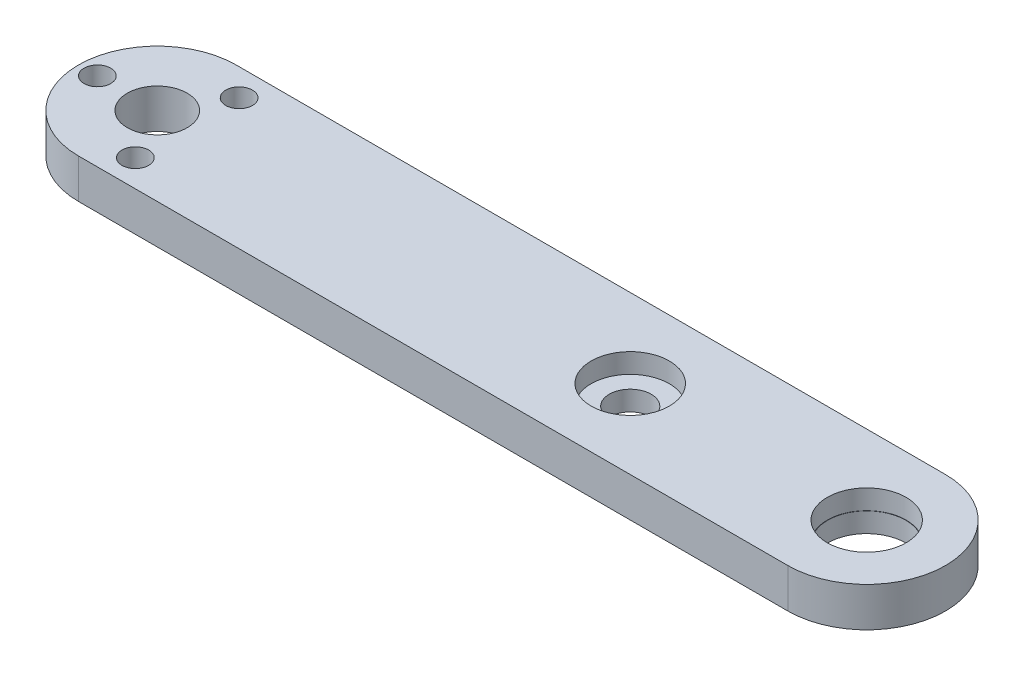
ISO-10303-21;
HEADER;
FILE_DESCRIPTION(('STEP AP214'),'2;1');
FILE_NAME('part.step','',(''),(''),'','','');
FILE_SCHEMA(('AUTOMOTIVE_DESIGN { 1 0 10303 214 1 1 1 1 }'));
ENDSEC;
DATA;
#1=APPLICATION_CONTEXT('core data for automotive mechanical design processes');
#2=APPLICATION_PROTOCOL_DEFINITION('international standard','automotive_design',2000,#1);
#3=PRODUCT_CONTEXT('',#1,'mechanical');
#4=PRODUCT('Part','Part','',(#3));
#5=PRODUCT_RELATED_PRODUCT_CATEGORY('part','',(#4));
#6=PRODUCT_DEFINITION_FORMATION('','',#4);
#7=PRODUCT_DEFINITION_CONTEXT('part definition',#1,'design');
#8=PRODUCT_DEFINITION('design','',#6,#7);
#9=PRODUCT_DEFINITION_SHAPE('','',#8);
#10=(LENGTH_UNIT() NAMED_UNIT(*) SI_UNIT(.MILLI.,.METRE.));
#11=(NAMED_UNIT(*) PLANE_ANGLE_UNIT() SI_UNIT($,.RADIAN.));
#12=(NAMED_UNIT(*) SI_UNIT($,.STERADIAN.) SOLID_ANGLE_UNIT());
#13=UNCERTAINTY_MEASURE_WITH_UNIT(LENGTH_MEASURE(1.E-05),#10,'distance_accuracy_value','');
#14=(GEOMETRIC_REPRESENTATION_CONTEXT(3) GLOBAL_UNCERTAINTY_ASSIGNED_CONTEXT((#13)) GLOBAL_UNIT_ASSIGNED_CONTEXT((#10,
#11,#12)) REPRESENTATION_CONTEXT('',''));
#15=CARTESIAN_POINT('',(0.,0.,0.));
#16=DIRECTION('',(0.,0.,1.));
#17=DIRECTION('',(1.,0.,0.));
#18=AXIS2_PLACEMENT_3D('',#15,#16,#17);
#19=CARTESIAN_POINT('',(0.,6.35,0.));
#20=DIRECTION('',(0.,1.,0.));
#21=DIRECTION('',(0.,0.,1.));
#22=AXIS2_PLACEMENT_3D('',#19,#20,#21);
#23=PLANE('',#22);
#24=CARTESIAN_POINT('',(76.2,6.35,0.));
#25=DIRECTION('',(0.,1.,0.));
#26=DIRECTION('',(0.,0.,1.));
#27=AXIS2_PLACEMENT_3D('',#24,#25,#26);
#28=CIRCLE('',#27,6.29919999999999);
#29=CARTESIAN_POINT('',(76.2,6.35,6.29919999999999));
#30=VERTEX_POINT('',#29);
#31=EDGE_CURVE('E308',#30,#30,#28,.T.);
#32=ORIENTED_EDGE('',*,*,#31,.F.);
#33=EDGE_LOOP('',(#32));
#34=FACE_BOUND('',#33,.T.);
#35=CARTESIAN_POINT('',(114.3,6.35,0.));
#36=DIRECTION('',(0.,1.,0.));
#37=DIRECTION('',(0.,0.,1.));
#38=AXIS2_PLACEMENT_3D('',#35,#36,#37);
#39=CIRCLE('',#38,6.35);
#40=CARTESIAN_POINT('',(114.3,6.35,6.34999999999998));
#41=VERTEX_POINT('',#40);
#42=EDGE_CURVE('E301',#41,#41,#39,.T.);
#43=ORIENTED_EDGE('',*,*,#42,.F.);
#44=EDGE_LOOP('',(#43));
#45=FACE_BOUND('',#44,.T.);
#46=CARTESIAN_POINT('',(-9.652,6.35,0.));
#47=DIRECTION('',(0.,1.,0.));
#48=DIRECTION('',(0.,0.,1.));
#49=AXIS2_PLACEMENT_3D('',#46,#47,#48);
#50=CIRCLE('',#49,2.15265);
#51=CARTESIAN_POINT('',(-9.652,6.35,2.15265));
#52=VERTEX_POINT('',#51);
#53=EDGE_CURVE('E125',#52,#52,#50,.T.);
#54=ORIENTED_EDGE('',*,*,#53,.F.);
#55=EDGE_LOOP('',(#54));
#56=FACE_BOUND('',#55,.T.);
#57=CARTESIAN_POINT('',(4.82600000000004,6.35,-8.35887719732738));
#58=DIRECTION('',(0.,1.,0.));
#59=DIRECTION('',(0.,0.,1.));
#60=AXIS2_PLACEMENT_3D('',#57,#58,#59);
#61=CIRCLE('',#60,2.15265);
#62=CARTESIAN_POINT('',(4.82600000000004,6.35,-6.20622719732738));
#63=VERTEX_POINT('',#62);
#64=EDGE_CURVE('E115',#63,#63,#61,.T.);
#65=ORIENTED_EDGE('',*,*,#64,.F.);
#66=EDGE_LOOP('',(#65));
#67=FACE_BOUND('',#66,.T.);
#68=CARTESIAN_POINT('',(4.82600000000004,6.35,8.35887719732738));
#69=DIRECTION('',(0.,1.,0.));
#70=DIRECTION('',(0.,0.,1.));
#71=AXIS2_PLACEMENT_3D('',#68,#69,#70);
#72=CIRCLE('',#71,2.15265);
#73=CARTESIAN_POINT('',(4.82600000000004,6.35,10.5115271973274));
#74=VERTEX_POINT('',#73);
#75=EDGE_CURVE('E112',#74,#74,#72,.T.);
#76=ORIENTED_EDGE('',*,*,#75,.F.);
#77=EDGE_LOOP('',(#76));
#78=FACE_BOUND('',#77,.T.);
#79=CARTESIAN_POINT('',(0.,6.35,0.));
#80=DIRECTION('',(0.,1.,0.));
#81=DIRECTION('',(0.,0.,1.));
#82=AXIS2_PLACEMENT_3D('',#79,#80,#81);
#83=CIRCLE('',#82,12.7);
#84=CARTESIAN_POINT('',(0.,6.35,-12.7));
#85=VERTEX_POINT('',#84);
#86=CARTESIAN_POINT('',(0.,6.35,12.7));
#87=VERTEX_POINT('',#86);
#88=EDGE_CURVE('E87',#85,#87,#83,.T.);
#89=ORIENTED_EDGE('',*,*,#88,.T.);
#90=DIRECTION('',(1.,0.,0.));
#91=VECTOR('',#90,1.);
#92=CARTESIAN_POINT('',(114.3,6.35,12.7));
#93=LINE('',#92,#91);
#94=CARTESIAN_POINT('',(114.3,6.35,12.7));
#95=VERTEX_POINT('',#94);
#96=EDGE_CURVE('E82',#87,#95,#93,.T.);
#97=ORIENTED_EDGE('',*,*,#96,.T.);
#98=CARTESIAN_POINT('',(114.3,6.35,0.));
#99=DIRECTION('',(0.,1.,0.));
#100=DIRECTION('',(0.,0.,1.));
#101=AXIS2_PLACEMENT_3D('',#98,#99,#100);
#102=CIRCLE('',#101,12.7);
#103=CARTESIAN_POINT('',(114.3,6.35,-12.7));
#104=VERTEX_POINT('',#103);
#105=EDGE_CURVE('E85',#95,#104,#102,.T.);
#106=ORIENTED_EDGE('',*,*,#105,.T.);
#107=DIRECTION('',(-1.,0.,0.));
#108=VECTOR('',#107,1.);
#109=CARTESIAN_POINT('',(0.,6.35,-12.7));
#110=LINE('',#109,#108);
#111=EDGE_CURVE('E52',#104,#85,#110,.T.);
#112=ORIENTED_EDGE('',*,*,#111,.T.);
#113=EDGE_LOOP('',(#89,#97,#106,#112));
#114=FACE_BOUND('',#113,.T.);
#115=CARTESIAN_POINT('',(0.,6.35,0.));
#116=DIRECTION('',(0.,1.,0.));
#117=DIRECTION('',(0.,0.,1.));
#118=AXIS2_PLACEMENT_3D('',#115,#116,#117);
#119=CIRCLE('',#118,4.826);
#120=CARTESIAN_POINT('',(0.,6.35,4.826));
#121=VERTEX_POINT('',#120);
#122=EDGE_CURVE('E103',#121,#121,#119,.T.);
#123=ORIENTED_EDGE('',*,*,#122,.F.);
#124=EDGE_LOOP('',(#123));
#125=FACE_BOUND('',#124,.T.);
#126=ADVANCED_FACE('F33',(#34,#45,#56,#67,#78,#114,#125),#23,.T.);
#127=CARTESIAN_POINT('',(0.,0.,0.));
#128=DIRECTION('',(0.,1.,0.));
#129=DIRECTION('',(0.,0.,1.));
#130=AXIS2_PLACEMENT_3D('',#127,#128,#129);
#131=PLANE('',#130);
#132=CARTESIAN_POINT('',(76.2,0.,0.));
#133=DIRECTION('',(0.,1.,0.));
#134=DIRECTION('',(0.,0.,1.));
#135=AXIS2_PLACEMENT_3D('',#132,#133,#134);
#136=CIRCLE('',#135,3.373501);
#137=CARTESIAN_POINT('',(76.2,0.,3.373501));
#138=VERTEX_POINT('',#137);
#139=EDGE_CURVE('E322',#138,#138,#136,.T.);
#140=ORIENTED_EDGE('',*,*,#139,.T.);
#141=EDGE_LOOP('',(#140));
#142=FACE_BOUND('',#141,.T.);
#143=CARTESIAN_POINT('',(114.3,0.,0.));
#144=DIRECTION('',(0.,-1.,0.));
#145=DIRECTION('',(0.,0.,-1.));
#146=AXIS2_PLACEMENT_3D('',#143,#144,#145);
#147=CIRCLE('',#146,6.2992);
#148=CARTESIAN_POINT('',(114.3,0.,-6.2992));
#149=VERTEX_POINT('',#148);
#150=EDGE_CURVE('E314',#149,#149,#147,.T.);
#151=ORIENTED_EDGE('',*,*,#150,.F.);
#152=EDGE_LOOP('',(#151));
#153=FACE_BOUND('',#152,.T.);
#154=CARTESIAN_POINT('',(-9.652,0.,0.));
#155=DIRECTION('',(0.,1.,0.));
#156=DIRECTION('',(0.,0.,1.));
#157=AXIS2_PLACEMENT_3D('',#154,#155,#156);
#158=CIRCLE('',#157,2.15265);
#159=CARTESIAN_POINT('',(-9.652,0.,2.15265));
#160=VERTEX_POINT('',#159);
#161=EDGE_CURVE('E37',#160,#160,#158,.T.);
#162=ORIENTED_EDGE('',*,*,#161,.T.);
#163=EDGE_LOOP('',(#162));
#164=FACE_BOUND('',#163,.T.);
#165=CARTESIAN_POINT('',(4.82600000000004,0.,-8.35887719732738));
#166=DIRECTION('',(0.,1.,0.));
#167=DIRECTION('',(0.,0.,1.));
#168=AXIS2_PLACEMENT_3D('',#165,#166,#167);
#169=CIRCLE('',#168,2.15265);
#170=CARTESIAN_POINT('',(4.82600000000004,0.,-6.20622719732738));
#171=VERTEX_POINT('',#170);
#172=EDGE_CURVE('E113',#171,#171,#169,.T.);
#173=ORIENTED_EDGE('',*,*,#172,.T.);
#174=EDGE_LOOP('',(#173));
#175=FACE_BOUND('',#174,.T.);
#176=CARTESIAN_POINT('',(4.82600000000004,0.,8.35887719732738));
#177=DIRECTION('',(0.,1.,0.));
#178=DIRECTION('',(0.,0.,1.));
#179=AXIS2_PLACEMENT_3D('',#176,#177,#178);
#180=CIRCLE('',#179,2.15265);
#181=CARTESIAN_POINT('',(4.82600000000004,0.,10.5115271973274));
#182=VERTEX_POINT('',#181);
#183=EDGE_CURVE('E109',#182,#182,#180,.T.);
#184=ORIENTED_EDGE('',*,*,#183,.T.);
#185=EDGE_LOOP('',(#184));
#186=FACE_BOUND('',#185,.T.);
#187=CARTESIAN_POINT('',(0.,0.,0.));
#188=DIRECTION('',(0.,1.,0.));
#189=DIRECTION('',(0.,0.,1.));
#190=AXIS2_PLACEMENT_3D('',#187,#188,#189);
#191=CIRCLE('',#190,12.7);
#192=CARTESIAN_POINT('',(0.,0.,-12.7));
#193=VERTEX_POINT('',#192);
#194=CARTESIAN_POINT('',(0.,0.,12.7));
#195=VERTEX_POINT('',#194);
#196=EDGE_CURVE('E100',#193,#195,#191,.T.);
#197=ORIENTED_EDGE('',*,*,#196,.F.);
#198=DIRECTION('',(-1.,0.,0.));
#199=VECTOR('',#198,1.);
#200=CARTESIAN_POINT('',(0.,0.,-12.7));
#201=LINE('',#200,#199);
#202=CARTESIAN_POINT('',(114.3,0.,-12.7));
#203=VERTEX_POINT('',#202);
#204=EDGE_CURVE('E75',#203,#193,#201,.T.);
#205=ORIENTED_EDGE('',*,*,#204,.F.);
#206=CARTESIAN_POINT('',(114.3,0.,0.));
#207=DIRECTION('',(0.,1.,0.));
#208=DIRECTION('',(0.,0.,1.));
#209=AXIS2_PLACEMENT_3D('',#206,#207,#208);
#210=CIRCLE('',#209,12.7);
#211=CARTESIAN_POINT('',(114.3,0.,12.7));
#212=VERTEX_POINT('',#211);
#213=EDGE_CURVE('E69',#212,#203,#210,.T.);
#214=ORIENTED_EDGE('',*,*,#213,.F.);
#215=DIRECTION('',(1.,0.,0.));
#216=VECTOR('',#215,1.);
#217=CARTESIAN_POINT('',(114.3,0.,12.7));
#218=LINE('',#217,#216);
#219=EDGE_CURVE('E91',#195,#212,#218,.T.);
#220=ORIENTED_EDGE('',*,*,#219,.F.);
#221=EDGE_LOOP('',(#197,#205,#214,#220));
#222=FACE_BOUND('',#221,.T.);
#223=CARTESIAN_POINT('',(0.,0.,0.));
#224=DIRECTION('',(0.,1.,0.));
#225=DIRECTION('',(0.,0.,1.));
#226=AXIS2_PLACEMENT_3D('',#223,#224,#225);
#227=CIRCLE('',#226,4.826);
#228=CARTESIAN_POINT('',(0.,0.,4.826));
#229=VERTEX_POINT('',#228);
#230=EDGE_CURVE('E111',#229,#229,#227,.T.);
#231=ORIENTED_EDGE('',*,*,#230,.T.);
#232=EDGE_LOOP('',(#231));
#233=FACE_BOUND('',#232,.T.);
#234=ADVANCED_FACE('F134',(#142,#153,#164,#175,#186,#222,#233),#131,.F.);
#235=CARTESIAN_POINT('',(0.,6.35,0.));
#236=DIRECTION('',(0.,-1.,0.));
#237=DIRECTION('',(0.,0.,-1.));
#238=AXIS2_PLACEMENT_3D('',#235,#236,#237);
#239=CYLINDRICAL_SURFACE('',#238,12.7);
#240=ORIENTED_EDGE('',*,*,#196,.T.);
#241=DIRECTION('',(0.,-1.,0.));
#242=VECTOR('',#241,1.);
#243=CARTESIAN_POINT('',(0.,6.35,12.7));
#244=LINE('',#243,#242);
#245=EDGE_CURVE('E11',#87,#195,#244,.T.);
#246=ORIENTED_EDGE('',*,*,#245,.F.);
#247=ORIENTED_EDGE('',*,*,#88,.F.);
#248=DIRECTION('',(0.,-1.,0.));
#249=VECTOR('',#248,1.);
#250=CARTESIAN_POINT('',(0.,6.35,-12.7));
#251=LINE('',#250,#249);
#252=EDGE_CURVE('E96',#85,#193,#251,.T.);
#253=ORIENTED_EDGE('',*,*,#252,.T.);
#254=EDGE_LOOP('',(#240,#246,#247,#253));
#255=FACE_BOUND('',#254,.T.);
#256=ADVANCED_FACE('F35',(#255),#239,.T.);
#257=CARTESIAN_POINT('',(114.3,6.35,12.7));
#258=DIRECTION('',(0.,0.,-1.));
#259=DIRECTION('',(-1.,0.,0.));
#260=AXIS2_PLACEMENT_3D('',#257,#258,#259);
#261=PLANE('',#260);
#262=ORIENTED_EDGE('',*,*,#219,.T.);
#263=DIRECTION('',(0.,-1.,0.));
#264=VECTOR('',#263,1.);
#265=CARTESIAN_POINT('',(114.3,6.35,12.7));
#266=LINE('',#265,#264);
#267=EDGE_CURVE('E43',#95,#212,#266,.T.);
#268=ORIENTED_EDGE('',*,*,#267,.F.);
#269=ORIENTED_EDGE('',*,*,#96,.F.);
#270=ORIENTED_EDGE('',*,*,#245,.T.);
#271=EDGE_LOOP('',(#262,#268,#269,#270));
#272=FACE_BOUND('',#271,.T.);
#273=ADVANCED_FACE('F90',(#272),#261,.F.);
#274=CARTESIAN_POINT('',(114.3,6.35,0.));
#275=DIRECTION('',(0.,-1.,0.));
#276=DIRECTION('',(0.,0.,-1.));
#277=AXIS2_PLACEMENT_3D('',#274,#275,#276);
#278=CYLINDRICAL_SURFACE('',#277,12.7);
#279=ORIENTED_EDGE('',*,*,#213,.T.);
#280=DIRECTION('',(0.,-1.,0.));
#281=VECTOR('',#280,1.);
#282=CARTESIAN_POINT('',(114.3,6.35,-12.7));
#283=LINE('',#282,#281);
#284=EDGE_CURVE('E92',#104,#203,#283,.T.);
#285=ORIENTED_EDGE('',*,*,#284,.F.);
#286=ORIENTED_EDGE('',*,*,#105,.F.);
#287=ORIENTED_EDGE('',*,*,#267,.T.);
#288=EDGE_LOOP('',(#279,#285,#286,#287));
#289=FACE_BOUND('',#288,.T.);
#290=ADVANCED_FACE('F94',(#289),#278,.T.);
#291=CARTESIAN_POINT('',(0.,6.35,-12.7));
#292=DIRECTION('',(0.,0.,1.));
#293=DIRECTION('',(1.,0.,0.));
#294=AXIS2_PLACEMENT_3D('',#291,#292,#293);
#295=PLANE('',#294);
#296=ORIENTED_EDGE('',*,*,#204,.T.);
#297=ORIENTED_EDGE('',*,*,#252,.F.);
#298=ORIENTED_EDGE('',*,*,#111,.F.);
#299=ORIENTED_EDGE('',*,*,#284,.T.);
#300=EDGE_LOOP('',(#296,#297,#298,#299));
#301=FACE_BOUND('',#300,.T.);
#302=ADVANCED_FACE('F139',(#301),#295,.F.);
#303=CARTESIAN_POINT('',(0.,6.35,0.));
#304=DIRECTION('',(0.,-1.,0.));
#305=DIRECTION('',(0.,0.,-1.));
#306=AXIS2_PLACEMENT_3D('',#303,#304,#305);
#307=CYLINDRICAL_SURFACE('',#306,4.826);
#308=ORIENTED_EDGE('',*,*,#122,.T.);
#309=EDGE_LOOP('',(#308));
#310=FACE_BOUND('',#309,.T.);
#311=ORIENTED_EDGE('',*,*,#230,.F.);
#312=EDGE_LOOP('',(#311));
#313=FACE_BOUND('',#312,.T.);
#314=ADVANCED_FACE('F136',(#310,#313),#307,.F.);
#315=CARTESIAN_POINT('',(4.82600000000004,6.35,8.35887719732738));
#316=DIRECTION('',(0.,1.,0.));
#317=DIRECTION('',(0.,0.,1.));
#318=AXIS2_PLACEMENT_3D('',#315,#316,#317);
#319=CYLINDRICAL_SURFACE('',#318,2.15265);
#320=ORIENTED_EDGE('',*,*,#75,.T.);
#321=EDGE_LOOP('',(#320));
#322=FACE_BOUND('',#321,.T.);
#323=ORIENTED_EDGE('',*,*,#183,.F.);
#324=EDGE_LOOP('',(#323));
#325=FACE_BOUND('',#324,.T.);
#326=ADVANCED_FACE('F138',(#322,#325),#319,.F.);
#327=CARTESIAN_POINT('',(4.82600000000004,6.35,-8.35887719732738));
#328=DIRECTION('',(0.,1.,0.));
#329=DIRECTION('',(0.,0.,1.));
#330=AXIS2_PLACEMENT_3D('',#327,#328,#329);
#331=CYLINDRICAL_SURFACE('',#330,2.15265);
#332=ORIENTED_EDGE('',*,*,#64,.T.);
#333=EDGE_LOOP('',(#332));
#334=FACE_BOUND('',#333,.T.);
#335=ORIENTED_EDGE('',*,*,#172,.F.);
#336=EDGE_LOOP('',(#335));
#337=FACE_BOUND('',#336,.T.);
#338=ADVANCED_FACE('F146',(#334,#337),#331,.F.);
#339=CARTESIAN_POINT('',(-9.652,6.35,0.));
#340=DIRECTION('',(0.,1.,0.));
#341=DIRECTION('',(0.,0.,1.));
#342=AXIS2_PLACEMENT_3D('',#339,#340,#341);
#343=CYLINDRICAL_SURFACE('',#342,2.15265);
#344=ORIENTED_EDGE('',*,*,#53,.T.);
#345=EDGE_LOOP('',(#344));
#346=FACE_BOUND('',#345,.T.);
#347=ORIENTED_EDGE('',*,*,#161,.F.);
#348=EDGE_LOOP('',(#347));
#349=FACE_BOUND('',#348,.T.);
#350=ADVANCED_FACE('F224',(#346,#349),#343,.F.);
#351=CARTESIAN_POINT('',(114.3,3.175,0.));
#352=DIRECTION('',(0.,1.,0.));
#353=DIRECTION('',(0.,0.,1.));
#354=AXIS2_PLACEMENT_3D('',#351,#352,#353);
#355=CYLINDRICAL_SURFACE('',#354,6.35);
#356=CARTESIAN_POINT('',(114.3,3.175,0.));
#357=DIRECTION('',(0.,1.,0.));
#358=DIRECTION('',(0.,0.,1.));
#359=AXIS2_PLACEMENT_3D('',#356,#357,#358);
#360=CIRCLE('',#359,6.35);
#361=CARTESIAN_POINT('',(114.3,3.175,6.34999999999998));
#362=VERTEX_POINT('',#361);
#363=EDGE_CURVE('E299',#362,#362,#360,.T.);
#364=ORIENTED_EDGE('',*,*,#363,.F.);
#365=EDGE_LOOP('',(#364));
#366=FACE_BOUND('',#365,.T.);
#367=ORIENTED_EDGE('',*,*,#42,.T.);
#368=EDGE_LOOP('',(#367));
#369=FACE_BOUND('',#368,.T.);
#370=ADVANCED_FACE('F220',(#366,#369),#355,.F.);
#371=CARTESIAN_POINT('',(114.3,3.175,0.));
#372=DIRECTION('',(0.,1.,0.));
#373=DIRECTION('',(0.,0.,1.));
#374=AXIS2_PLACEMENT_3D('',#371,#372,#373);
#375=PLANE('',#374);
#376=CARTESIAN_POINT('',(114.3,3.175,0.));
#377=DIRECTION('',(0.,-1.,0.));
#378=DIRECTION('',(0.,0.,-1.));
#379=AXIS2_PLACEMENT_3D('',#376,#377,#378);
#380=CIRCLE('',#379,6.2992);
#381=CARTESIAN_POINT('',(114.3,3.175,-6.2992));
#382=VERTEX_POINT('',#381);
#383=EDGE_CURVE('E311',#382,#382,#380,.T.);
#384=ORIENTED_EDGE('',*,*,#383,.T.);
#385=EDGE_LOOP('',(#384));
#386=FACE_BOUND('',#385,.T.);
#387=ORIENTED_EDGE('',*,*,#363,.T.);
#388=EDGE_LOOP('',(#387));
#389=FACE_BOUND('',#388,.T.);
#390=ADVANCED_FACE('F216',(#386,#389),#375,.T.);
#391=CARTESIAN_POINT('',(76.2,3.175,0.));
#392=DIRECTION('',(0.,1.,0.));
#393=DIRECTION('',(0.,0.,1.));
#394=AXIS2_PLACEMENT_3D('',#391,#392,#393);
#395=CYLINDRICAL_SURFACE('',#394,6.29919999999999);
#396=CARTESIAN_POINT('',(76.2,3.175,0.));
#397=DIRECTION('',(0.,1.,0.));
#398=DIRECTION('',(0.,0.,1.));
#399=AXIS2_PLACEMENT_3D('',#396,#397,#398);
#400=CIRCLE('',#399,6.29919999999999);
#401=CARTESIAN_POINT('',(76.2,3.175,6.29919999999999));
#402=VERTEX_POINT('',#401);
#403=EDGE_CURVE('E306',#402,#402,#400,.T.);
#404=ORIENTED_EDGE('',*,*,#403,.F.);
#405=EDGE_LOOP('',(#404));
#406=FACE_BOUND('',#405,.T.);
#407=ORIENTED_EDGE('',*,*,#31,.T.);
#408=EDGE_LOOP('',(#407));
#409=FACE_BOUND('',#408,.T.);
#410=ADVANCED_FACE('F192',(#406,#409),#395,.F.);
#411=CARTESIAN_POINT('',(76.2,3.175,0.));
#412=DIRECTION('',(0.,1.,0.));
#413=DIRECTION('',(0.,0.,1.));
#414=AXIS2_PLACEMENT_3D('',#411,#412,#413);
#415=PLANE('',#414);
#416=CARTESIAN_POINT('',(76.2,3.175,0.));
#417=DIRECTION('',(0.,1.,0.));
#418=DIRECTION('',(0.,0.,1.));
#419=AXIS2_PLACEMENT_3D('',#416,#417,#418);
#420=CIRCLE('',#419,3.37350099999999);
#421=CARTESIAN_POINT('',(76.2,3.175,3.37350099999999));
#422=VERTEX_POINT('',#421);
#423=EDGE_CURVE('E317',#422,#422,#420,.T.);
#424=ORIENTED_EDGE('',*,*,#423,.F.);
#425=EDGE_LOOP('',(#424));
#426=FACE_BOUND('',#425,.T.);
#427=ORIENTED_EDGE('',*,*,#403,.T.);
#428=EDGE_LOOP('',(#427));
#429=FACE_BOUND('',#428,.T.);
#430=ADVANCED_FACE('F187',(#426,#429),#415,.T.);
#431=CARTESIAN_POINT('',(114.3,3.175,0.));
#432=DIRECTION('',(0.,-1.,0.));
#433=DIRECTION('',(0.,0.,-1.));
#434=AXIS2_PLACEMENT_3D('',#431,#432,#433);
#435=CYLINDRICAL_SURFACE('',#434,6.2992);
#436=ORIENTED_EDGE('',*,*,#383,.F.);
#437=EDGE_LOOP('',(#436));
#438=FACE_BOUND('',#437,.T.);
#439=ORIENTED_EDGE('',*,*,#150,.T.);
#440=EDGE_LOOP('',(#439));
#441=FACE_BOUND('',#440,.T.);
#442=ADVANCED_FACE('F182',(#438,#441),#435,.F.);
#443=CARTESIAN_POINT('',(76.2,6.35,0.));
#444=DIRECTION('',(0.,1.,0.));
#445=DIRECTION('',(0.,0.,1.));
#446=AXIS2_PLACEMENT_3D('',#443,#444,#445);
#447=CYLINDRICAL_SURFACE('',#446,3.37350099999999);
#448=ORIENTED_EDGE('',*,*,#423,.T.);
#449=EDGE_LOOP('',(#448));
#450=FACE_BOUND('',#449,.T.);
#451=ORIENTED_EDGE('',*,*,#139,.F.);
#452=EDGE_LOOP('',(#451));
#453=FACE_BOUND('',#452,.T.);
#454=ADVANCED_FACE('F200',(#450,#453),#447,.F.);
#455=CLOSED_SHELL('',(#126,#234,#256,#273,#290,#302,#314,#326,#338,#350,#370,#390,#410,#430,
#442,#454));
#456=MANIFOLD_SOLID_BREP('B2',#455);
#457=ADVANCED_BREP_SHAPE_REPRESENTATION('',(#18,#456),#14);
#458=SHAPE_DEFINITION_REPRESENTATION(#9,#457);
ENDSEC;
END-ISO-10303-21;
